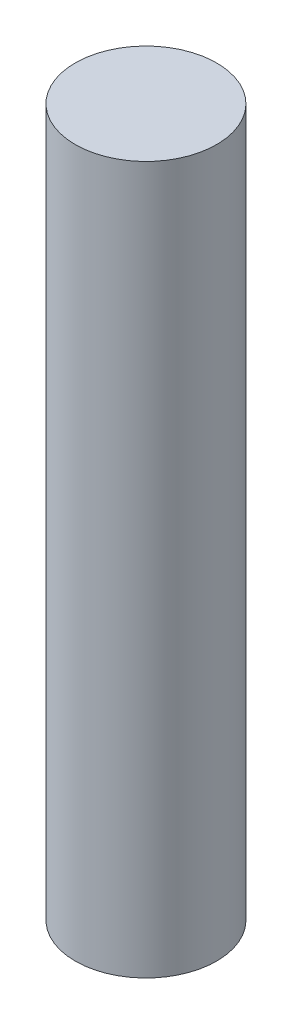
ISO-10303-21;
HEADER;
FILE_DESCRIPTION(('STEP AP214'),'2;1');
FILE_NAME('part.step','',(''),(''),'','','');
FILE_SCHEMA(('AUTOMOTIVE_DESIGN { 1 0 10303 214 1 1 1 1 }'));
ENDSEC;
DATA;
#1=APPLICATION_CONTEXT('core data for automotive mechanical design processes');
#2=APPLICATION_PROTOCOL_DEFINITION('international standard','automotive_design',2000,#1);
#3=PRODUCT_CONTEXT('',#1,'mechanical');
#4=PRODUCT('Part','Part','',(#3));
#5=PRODUCT_RELATED_PRODUCT_CATEGORY('part','',(#4));
#6=PRODUCT_DEFINITION_FORMATION('','',#4);
#7=PRODUCT_DEFINITION_CONTEXT('part definition',#1,'design');
#8=PRODUCT_DEFINITION('design','',#6,#7);
#9=PRODUCT_DEFINITION_SHAPE('','',#8);
#10=(LENGTH_UNIT() NAMED_UNIT(*) SI_UNIT(.MILLI.,.METRE.));
#11=(NAMED_UNIT(*) PLANE_ANGLE_UNIT() SI_UNIT($,.RADIAN.));
#12=(NAMED_UNIT(*) SI_UNIT($,.STERADIAN.) SOLID_ANGLE_UNIT());
#13=UNCERTAINTY_MEASURE_WITH_UNIT(LENGTH_MEASURE(1.E-05),#10,'distance_accuracy_value','');
#14=(GEOMETRIC_REPRESENTATION_CONTEXT(3) GLOBAL_UNCERTAINTY_ASSIGNED_CONTEXT((#13)) GLOBAL_UNIT_ASSIGNED_CONTEXT((#10,
#11,#12)) REPRESENTATION_CONTEXT('',''));
#15=CARTESIAN_POINT('',(0.,0.,0.));
#16=DIRECTION('',(0.,0.,1.));
#17=DIRECTION('',(1.,0.,0.));
#18=AXIS2_PLACEMENT_3D('',#15,#16,#17);
#19=CARTESIAN_POINT('',(0.,177.8,0.));
#20=DIRECTION('',(0.,-1.,0.));
#21=DIRECTION('',(0.,0.,-1.));
#22=AXIS2_PLACEMENT_3D('',#19,#20,#21);
#23=CYLINDRICAL_SURFACE('',#22,17.78);
#24=CARTESIAN_POINT('',(0.,177.8,0.));
#25=DIRECTION('',(0.,1.,0.));
#26=DIRECTION('',(0.,0.,1.));
#27=AXIS2_PLACEMENT_3D('',#24,#25,#26);
#28=CIRCLE('',#27,17.78);
#29=CARTESIAN_POINT('',(0.,177.8,17.78));
#30=VERTEX_POINT('',#29);
#31=EDGE_CURVE('E10',#30,#30,#28,.T.);
#32=ORIENTED_EDGE('',*,*,#31,.F.);
#33=EDGE_LOOP('',(#32));
#34=FACE_BOUND('',#33,.T.);
#35=CARTESIAN_POINT('',(0.,0.,0.));
#36=DIRECTION('',(0.,1.,0.));
#37=DIRECTION('',(0.,0.,1.));
#38=AXIS2_PLACEMENT_3D('',#35,#36,#37);
#39=CIRCLE('',#38,17.78);
#40=CARTESIAN_POINT('',(0.,0.,17.78));
#41=VERTEX_POINT('',#40);
#42=EDGE_CURVE('E34',#41,#41,#39,.T.);
#43=ORIENTED_EDGE('',*,*,#42,.T.);
#44=EDGE_LOOP('',(#43));
#45=FACE_BOUND('',#44,.T.);
#46=ADVANCED_FACE('F31',(#34,#45),#23,.T.);
#47=CARTESIAN_POINT('',(0.,177.8,0.));
#48=DIRECTION('',(0.,1.,0.));
#49=DIRECTION('',(0.,0.,1.));
#50=AXIS2_PLACEMENT_3D('',#47,#48,#49);
#51=PLANE('',#50);
#52=ORIENTED_EDGE('',*,*,#31,.T.);
#53=EDGE_LOOP('',(#52));
#54=FACE_BOUND('',#53,.T.);
#55=ADVANCED_FACE('F60',(#54),#51,.T.);
#56=CARTESIAN_POINT('',(0.,0.,0.));
#57=DIRECTION('',(0.,1.,0.));
#58=DIRECTION('',(0.,0.,1.));
#59=AXIS2_PLACEMENT_3D('',#56,#57,#58);
#60=PLANE('',#59);
#61=CARTESIAN_POINT('',(0.,0.,0.));
#62=DIRECTION('',(0.,-1.,0.));
#63=DIRECTION('',(0.,0.,-1.));
#64=AXIS2_PLACEMENT_3D('',#61,#62,#63);
#65=CIRCLE('',#64,3.175);
#66=CARTESIAN_POINT('',(0.,0.,-3.175));
#67=VERTEX_POINT('',#66);
#68=EDGE_CURVE('E43',#67,#67,#65,.T.);
#69=ORIENTED_EDGE('',*,*,#68,.F.);
#70=EDGE_LOOP('',(#69));
#71=FACE_BOUND('',#70,.T.);
#72=ORIENTED_EDGE('',*,*,#42,.F.);
#73=EDGE_LOOP('',(#72));
#74=FACE_BOUND('',#73,.T.);
#75=ADVANCED_FACE('F54',(#71,#74),#60,.F.);
#76=CARTESIAN_POINT('',(0.,152.4,0.));
#77=DIRECTION('',(0.,-1.,0.));
#78=DIRECTION('',(0.,0.,-1.));
#79=AXIS2_PLACEMENT_3D('',#76,#77,#78);
#80=CYLINDRICAL_SURFACE('',#79,3.175);
#81=CARTESIAN_POINT('',(0.,152.4,0.));
#82=DIRECTION('',(0.,-1.,0.));
#83=DIRECTION('',(0.,0.,-1.));
#84=AXIS2_PLACEMENT_3D('',#81,#82,#83);
#85=CIRCLE('',#84,3.175);
#86=CARTESIAN_POINT('',(0.,152.4,-3.175));
#87=VERTEX_POINT('',#86);
#88=EDGE_CURVE('E41',#87,#87,#85,.T.);
#89=ORIENTED_EDGE('',*,*,#88,.F.);
#90=EDGE_LOOP('',(#89));
#91=FACE_BOUND('',#90,.T.);
#92=ORIENTED_EDGE('',*,*,#68,.T.);
#93=EDGE_LOOP('',(#92));
#94=FACE_BOUND('',#93,.T.);
#95=ADVANCED_FACE('F51',(#91,#94),#80,.F.);
#96=CARTESIAN_POINT('',(0.,152.4,0.));
#97=DIRECTION('',(0.,-1.,0.));
#98=DIRECTION('',(0.,0.,-1.));
#99=AXIS2_PLACEMENT_3D('',#96,#97,#98);
#100=PLANE('',#99);
#101=ORIENTED_EDGE('',*,*,#88,.T.);
#102=EDGE_LOOP('',(#101));
#103=FACE_BOUND('',#102,.T.);
#104=ADVANCED_FACE('F49',(#103),#100,.T.);
#105=CLOSED_SHELL('',(#46,#55,#75,#95,#104));
#106=MANIFOLD_SOLID_BREP('B2',#105);
#107=ADVANCED_BREP_SHAPE_REPRESENTATION('',(#18,#106),#14);
#108=SHAPE_DEFINITION_REPRESENTATION(#9,#107);
ENDSEC;
END-ISO-10303-21;
